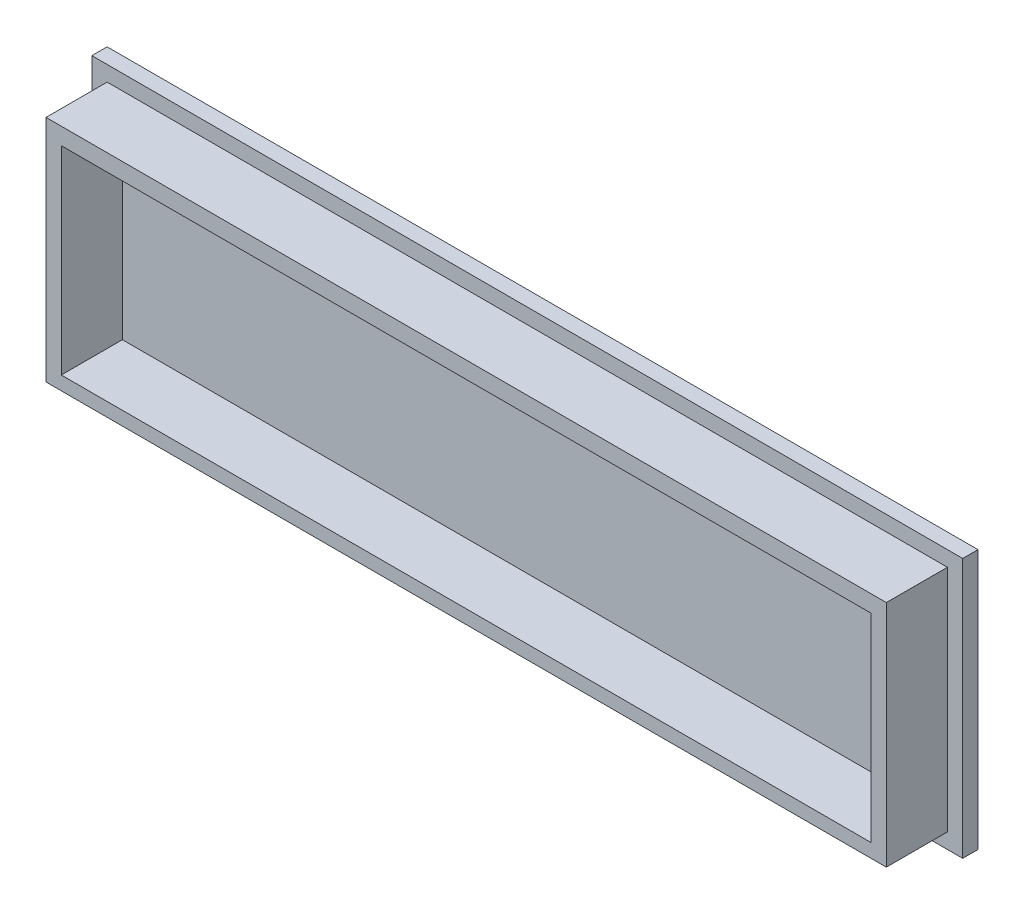
ISO-10303-21;
HEADER;
FILE_DESCRIPTION(('STEP AP214'),'2;1');
FILE_NAME('part.step','',(''),(''),'','','');
FILE_SCHEMA(('AUTOMOTIVE_DESIGN { 1 0 10303 214 1 1 1 1 }'));
ENDSEC;
DATA;
#1=APPLICATION_CONTEXT('core data for automotive mechanical design processes');
#2=APPLICATION_PROTOCOL_DEFINITION('international standard','automotive_design',2000,#1);
#3=PRODUCT_CONTEXT('',#1,'mechanical');
#4=PRODUCT('Part','Part','',(#3));
#5=PRODUCT_RELATED_PRODUCT_CATEGORY('part','',(#4));
#6=PRODUCT_DEFINITION_FORMATION('','',#4);
#7=PRODUCT_DEFINITION_CONTEXT('part definition',#1,'design');
#8=PRODUCT_DEFINITION('design','',#6,#7);
#9=PRODUCT_DEFINITION_SHAPE('','',#8);
#10=(LENGTH_UNIT() NAMED_UNIT(*) SI_UNIT(.MILLI.,.METRE.));
#11=(NAMED_UNIT(*) PLANE_ANGLE_UNIT() SI_UNIT($,.RADIAN.));
#12=(NAMED_UNIT(*) SI_UNIT($,.STERADIAN.) SOLID_ANGLE_UNIT());
#13=UNCERTAINTY_MEASURE_WITH_UNIT(LENGTH_MEASURE(1.E-05),#10,'distance_accuracy_value','');
#14=(GEOMETRIC_REPRESENTATION_CONTEXT(3) GLOBAL_UNCERTAINTY_ASSIGNED_CONTEXT((#13)) GLOBAL_UNIT_ASSIGNED_CONTEXT((#10,
#11,#12)) REPRESENTATION_CONTEXT('',''));
#15=CARTESIAN_POINT('',(0.,0.,0.));
#16=DIRECTION('',(0.,0.,1.));
#17=DIRECTION('',(1.,0.,0.));
#18=AXIS2_PLACEMENT_3D('',#15,#16,#17);
#19=CARTESIAN_POINT('',(-139.012237762238,10.5113636363637,5.));
#20=DIRECTION('',(1.,0.,0.));
#21=DIRECTION('',(0.,1.,0.));
#22=AXIS2_PLACEMENT_3D('',#19,#20,#21);
#23=PLANE('',#22);
#24=DIRECTION('',(0.,-1.,0.));
#25=VECTOR('',#24,1.);
#26=CARTESIAN_POINT('',(-139.012237762238,10.5113636363637,0.));
#27=LINE('',#26,#25);
#28=CARTESIAN_POINT('',(-139.012237762238,10.5113636363637,0.));
#29=VERTEX_POINT('',#28);
#30=CARTESIAN_POINT('',(-139.012237762238,-74.4886363636363,0.));
#31=VERTEX_POINT('',#30);
#32=EDGE_CURVE('E197',#29,#31,#27,.T.);
#33=ORIENTED_EDGE('',*,*,#32,.T.);
#34=DIRECTION('',(0.,0.,-1.));
#35=VECTOR('',#34,1.);
#36=CARTESIAN_POINT('',(-139.012237762238,-74.4886363636363,5.));
#37=LINE('',#36,#35);
#38=CARTESIAN_POINT('',(-139.012237762238,-74.4886363636363,5.));
#39=VERTEX_POINT('',#38);
#40=EDGE_CURVE('E11',#39,#31,#37,.T.);
#41=ORIENTED_EDGE('',*,*,#40,.F.);
#42=DIRECTION('',(0.,-1.,0.));
#43=VECTOR('',#42,1.);
#44=CARTESIAN_POINT('',(-139.012237762238,10.5113636363637,5.));
#45=LINE('',#44,#43);
#46=CARTESIAN_POINT('',(-139.012237762238,10.5113636363637,5.));
#47=VERTEX_POINT('',#46);
#48=EDGE_CURVE('E198',#47,#39,#45,.T.);
#49=ORIENTED_EDGE('',*,*,#48,.F.);
#50=DIRECTION('',(0.,0.,-1.));
#51=VECTOR('',#50,1.);
#52=CARTESIAN_POINT('',(-139.012237762238,10.5113636363637,5.));
#53=LINE('',#52,#51);
#54=EDGE_CURVE('E208',#47,#29,#53,.T.);
#55=ORIENTED_EDGE('',*,*,#54,.T.);
#56=EDGE_LOOP('',(#33,#41,#49,#55));
#57=FACE_BOUND('',#56,.T.);
#58=ADVANCED_FACE('F41',(#57),#23,.F.);
#59=CARTESIAN_POINT('',(-139.012237762238,-74.4886363636363,5.));
#60=DIRECTION('',(0.,1.,0.));
#61=DIRECTION('',(0.,0.,1.));
#62=AXIS2_PLACEMENT_3D('',#59,#60,#61);
#63=PLANE('',#62);
#64=DIRECTION('',(1.,0.,0.));
#65=VECTOR('',#64,1.);
#66=CARTESIAN_POINT('',(-139.012237762238,-74.4886363636363,0.));
#67=LINE('',#66,#65);
#68=CARTESIAN_POINT('',(145.987762237762,-74.4886363636363,0.));
#69=VERTEX_POINT('',#68);
#70=EDGE_CURVE('E211',#31,#69,#67,.T.);
#71=ORIENTED_EDGE('',*,*,#70,.T.);
#72=DIRECTION('',(0.,0.,-1.));
#73=VECTOR('',#72,1.);
#74=CARTESIAN_POINT('',(145.987762237762,-74.4886363636363,5.));
#75=LINE('',#74,#73);
#76=CARTESIAN_POINT('',(145.987762237762,-74.4886363636363,5.));
#77=VERTEX_POINT('',#76);
#78=EDGE_CURVE('E48',#77,#69,#75,.T.);
#79=ORIENTED_EDGE('',*,*,#78,.F.);
#80=DIRECTION('',(1.,0.,0.));
#81=VECTOR('',#80,1.);
#82=CARTESIAN_POINT('',(-139.012237762238,-74.4886363636363,5.));
#83=LINE('',#82,#81);
#84=EDGE_CURVE('E201',#39,#77,#83,.T.);
#85=ORIENTED_EDGE('',*,*,#84,.F.);
#86=ORIENTED_EDGE('',*,*,#40,.T.);
#87=EDGE_LOOP('',(#71,#79,#85,#86));
#88=FACE_BOUND('',#87,.T.);
#89=ADVANCED_FACE('F241',(#88),#63,.F.);
#90=CARTESIAN_POINT('',(145.987762237762,10.5113636363637,5.));
#91=DIRECTION('',(-1.,0.,0.));
#92=DIRECTION('',(0.,-1.,0.));
#93=AXIS2_PLACEMENT_3D('',#90,#91,#92);
#94=PLANE('',#93);
#95=DIRECTION('',(0.,1.,0.));
#96=VECTOR('',#95,1.);
#97=CARTESIAN_POINT('',(145.987762237762,10.5113636363637,0.));
#98=LINE('',#97,#96);
#99=CARTESIAN_POINT('',(145.987762237762,10.5113636363637,0.));
#100=VERTEX_POINT('',#99);
#101=EDGE_CURVE('E213',#69,#100,#98,.T.);
#102=ORIENTED_EDGE('',*,*,#101,.T.);
#103=DIRECTION('',(0.,0.,-1.));
#104=VECTOR('',#103,1.);
#105=CARTESIAN_POINT('',(145.987762237762,10.5113636363637,5.));
#106=LINE('',#105,#104);
#107=CARTESIAN_POINT('',(145.987762237762,10.5113636363637,5.));
#108=VERTEX_POINT('',#107);
#109=EDGE_CURVE('E218',#108,#100,#106,.T.);
#110=ORIENTED_EDGE('',*,*,#109,.F.);
#111=DIRECTION('',(0.,1.,0.));
#112=VECTOR('',#111,1.);
#113=CARTESIAN_POINT('',(145.987762237762,10.5113636363637,5.));
#114=LINE('',#113,#112);
#115=EDGE_CURVE('E204',#77,#108,#114,.T.);
#116=ORIENTED_EDGE('',*,*,#115,.F.);
#117=ORIENTED_EDGE('',*,*,#78,.T.);
#118=EDGE_LOOP('',(#102,#110,#116,#117));
#119=FACE_BOUND('',#118,.T.);
#120=ADVANCED_FACE('F225',(#119),#94,.F.);
#121=CARTESIAN_POINT('',(-139.012237762238,10.5113636363637,5.));
#122=DIRECTION('',(0.,-1.,0.));
#123=DIRECTION('',(0.,0.,-1.));
#124=AXIS2_PLACEMENT_3D('',#121,#122,#123);
#125=PLANE('',#124);
#126=DIRECTION('',(-1.,0.,0.));
#127=VECTOR('',#126,1.);
#128=CARTESIAN_POINT('',(-139.012237762238,10.5113636363637,0.));
#129=LINE('',#128,#127);
#130=EDGE_CURVE('E202',#100,#29,#129,.T.);
#131=ORIENTED_EDGE('',*,*,#130,.T.);
#132=ORIENTED_EDGE('',*,*,#54,.F.);
#133=DIRECTION('',(-1.,0.,0.));
#134=VECTOR('',#133,1.);
#135=CARTESIAN_POINT('',(-139.012237762238,10.5113636363637,5.));
#136=LINE('',#135,#134);
#137=EDGE_CURVE('E206',#108,#47,#136,.T.);
#138=ORIENTED_EDGE('',*,*,#137,.F.);
#139=ORIENTED_EDGE('',*,*,#109,.T.);
#140=EDGE_LOOP('',(#131,#132,#138,#139));
#141=FACE_BOUND('',#140,.T.);
#142=ADVANCED_FACE('F234',(#141),#125,.F.);
#143=CARTESIAN_POINT('',(0.,0.,5.));
#144=DIRECTION('',(0.,0.,1.));
#145=DIRECTION('',(1.,0.,0.));
#146=AXIS2_PLACEMENT_3D('',#143,#144,#145);
#147=PLANE('',#146);
#148=DIRECTION('',(0.,-1.,0.));
#149=VECTOR('',#148,1.);
#150=CARTESIAN_POINT('',(-134.012237762238,5.51136363636367,5.));
#151=LINE('',#150,#149);
#152=CARTESIAN_POINT('',(-134.012237762238,5.51136363636367,5.));
#153=VERTEX_POINT('',#152);
#154=CARTESIAN_POINT('',(-134.012237762238,-69.4886363636363,5.));
#155=VERTEX_POINT('',#154);
#156=EDGE_CURVE('E63',#153,#155,#151,.T.);
#157=ORIENTED_EDGE('',*,*,#156,.F.);
#158=DIRECTION('',(-1.,0.,0.));
#159=VECTOR('',#158,1.);
#160=CARTESIAN_POINT('',(-134.012237762238,5.51136363636367,5.));
#161=LINE('',#160,#159);
#162=CARTESIAN_POINT('',(140.987762237762,5.51136363636367,5.));
#163=VERTEX_POINT('',#162);
#164=EDGE_CURVE('E171',#163,#153,#161,.T.);
#165=ORIENTED_EDGE('',*,*,#164,.F.);
#166=DIRECTION('',(0.,1.,0.));
#167=VECTOR('',#166,1.);
#168=CARTESIAN_POINT('',(140.987762237762,5.51136363636367,5.));
#169=LINE('',#168,#167);
#170=CARTESIAN_POINT('',(140.987762237762,-69.4886363636363,5.));
#171=VERTEX_POINT('',#170);
#172=EDGE_CURVE('E182',#171,#163,#169,.T.);
#173=ORIENTED_EDGE('',*,*,#172,.F.);
#174=DIRECTION('',(1.,0.,0.));
#175=VECTOR('',#174,1.);
#176=CARTESIAN_POINT('',(-134.012237762238,-69.4886363636363,5.));
#177=LINE('',#176,#175);
#178=EDGE_CURVE('E179',#155,#171,#177,.T.);
#179=ORIENTED_EDGE('',*,*,#178,.F.);
#180=EDGE_LOOP('',(#157,#165,#173,#179));
#181=FACE_BOUND('',#180,.T.);
#182=ORIENTED_EDGE('',*,*,#48,.T.);
#183=ORIENTED_EDGE('',*,*,#84,.T.);
#184=ORIENTED_EDGE('',*,*,#115,.T.);
#185=ORIENTED_EDGE('',*,*,#137,.T.);
#186=EDGE_LOOP('',(#182,#183,#184,#185));
#187=FACE_BOUND('',#186,.T.);
#188=ADVANCED_FACE('F240',(#181,#187),#147,.T.);
#189=CARTESIAN_POINT('',(0.,0.,0.));
#190=DIRECTION('',(0.,0.,1.));
#191=DIRECTION('',(1.,0.,0.));
#192=AXIS2_PLACEMENT_3D('',#189,#190,#191);
#193=PLANE('',#192);
#194=ORIENTED_EDGE('',*,*,#32,.F.);
#195=ORIENTED_EDGE('',*,*,#130,.F.);
#196=ORIENTED_EDGE('',*,*,#101,.F.);
#197=ORIENTED_EDGE('',*,*,#70,.F.);
#198=EDGE_LOOP('',(#194,#195,#196,#197));
#199=FACE_BOUND('',#198,.T.);
#200=ADVANCED_FACE('F231',(#199),#193,.F.);
#201=CARTESIAN_POINT('',(-134.012237762238,5.51136363636367,25.));
#202=DIRECTION('',(1.,0.,0.));
#203=DIRECTION('',(0.,0.,-1.));
#204=AXIS2_PLACEMENT_3D('',#201,#202,#203);
#205=PLANE('',#204);
#206=ORIENTED_EDGE('',*,*,#156,.T.);
#207=DIRECTION('',(0.,0.,-1.));
#208=VECTOR('',#207,1.);
#209=CARTESIAN_POINT('',(-134.012237762238,-69.4886363636363,25.));
#210=LINE('',#209,#208);
#211=CARTESIAN_POINT('',(-134.012237762238,-69.4886363636363,25.));
#212=VERTEX_POINT('',#211);
#213=EDGE_CURVE('E194',#212,#155,#210,.T.);
#214=ORIENTED_EDGE('',*,*,#213,.F.);
#215=DIRECTION('',(0.,-1.,0.));
#216=VECTOR('',#215,1.);
#217=CARTESIAN_POINT('',(-134.012237762238,5.51136363636367,25.));
#218=LINE('',#217,#216);
#219=CARTESIAN_POINT('',(-134.012237762238,5.51136363636367,25.));
#220=VERTEX_POINT('',#219);
#221=EDGE_CURVE('E167',#220,#212,#218,.T.);
#222=ORIENTED_EDGE('',*,*,#221,.F.);
#223=DIRECTION('',(0.,0.,-1.));
#224=VECTOR('',#223,1.);
#225=CARTESIAN_POINT('',(-134.012237762238,5.51136363636367,25.));
#226=LINE('',#225,#224);
#227=EDGE_CURVE('E177',#220,#153,#226,.T.);
#228=ORIENTED_EDGE('',*,*,#227,.T.);
#229=EDGE_LOOP('',(#206,#214,#222,#228));
#230=FACE_BOUND('',#229,.T.);
#231=ADVANCED_FACE('F253',(#230),#205,.F.);
#232=CARTESIAN_POINT('',(-134.012237762238,-69.4886363636363,25.));
#233=DIRECTION('',(0.,1.,0.));
#234=DIRECTION('',(0.,0.,1.));
#235=AXIS2_PLACEMENT_3D('',#232,#233,#234);
#236=PLANE('',#235);
#237=ORIENTED_EDGE('',*,*,#178,.T.);
#238=DIRECTION('',(0.,0.,-1.));
#239=VECTOR('',#238,1.);
#240=CARTESIAN_POINT('',(140.987762237762,-69.4886363636363,25.));
#241=LINE('',#240,#239);
#242=CARTESIAN_POINT('',(140.987762237762,-69.4886363636363,25.));
#243=VERTEX_POINT('',#242);
#244=EDGE_CURVE('E191',#243,#171,#241,.T.);
#245=ORIENTED_EDGE('',*,*,#244,.F.);
#246=DIRECTION('',(1.,0.,0.));
#247=VECTOR('',#246,1.);
#248=CARTESIAN_POINT('',(-134.012237762238,-69.4886363636363,25.));
#249=LINE('',#248,#247);
#250=EDGE_CURVE('E170',#212,#243,#249,.T.);
#251=ORIENTED_EDGE('',*,*,#250,.F.);
#252=ORIENTED_EDGE('',*,*,#213,.T.);
#253=EDGE_LOOP('',(#237,#245,#251,#252));
#254=FACE_BOUND('',#253,.T.);
#255=ADVANCED_FACE('F258',(#254),#236,.F.);
#256=CARTESIAN_POINT('',(140.987762237762,5.51136363636367,25.));
#257=DIRECTION('',(-1.,0.,0.));
#258=DIRECTION('',(0.,0.,1.));
#259=AXIS2_PLACEMENT_3D('',#256,#257,#258);
#260=PLANE('',#259);
#261=ORIENTED_EDGE('',*,*,#172,.T.);
#262=DIRECTION('',(0.,0.,-1.));
#263=VECTOR('',#262,1.);
#264=CARTESIAN_POINT('',(140.987762237762,5.51136363636367,25.));
#265=LINE('',#264,#263);
#266=CARTESIAN_POINT('',(140.987762237762,5.51136363636367,25.));
#267=VERTEX_POINT('',#266);
#268=EDGE_CURVE('E188',#267,#163,#265,.T.);
#269=ORIENTED_EDGE('',*,*,#268,.F.);
#270=DIRECTION('',(0.,1.,0.));
#271=VECTOR('',#270,1.);
#272=CARTESIAN_POINT('',(140.987762237762,5.51136363636367,25.));
#273=LINE('',#272,#271);
#274=EDGE_CURVE('E173',#243,#267,#273,.T.);
#275=ORIENTED_EDGE('',*,*,#274,.F.);
#276=ORIENTED_EDGE('',*,*,#244,.T.);
#277=EDGE_LOOP('',(#261,#269,#275,#276));
#278=FACE_BOUND('',#277,.T.);
#279=ADVANCED_FACE('F262',(#278),#260,.F.);
#280=CARTESIAN_POINT('',(-134.012237762238,5.51136363636367,25.));
#281=DIRECTION('',(0.,-1.,0.));
#282=DIRECTION('',(0.,0.,-1.));
#283=AXIS2_PLACEMENT_3D('',#280,#281,#282);
#284=PLANE('',#283);
#285=ORIENTED_EDGE('',*,*,#164,.T.);
#286=ORIENTED_EDGE('',*,*,#227,.F.);
#287=DIRECTION('',(-1.,0.,0.));
#288=VECTOR('',#287,1.);
#289=CARTESIAN_POINT('',(-134.012237762238,5.51136363636367,25.));
#290=LINE('',#289,#288);
#291=EDGE_CURVE('E175',#267,#220,#290,.T.);
#292=ORIENTED_EDGE('',*,*,#291,.F.);
#293=ORIENTED_EDGE('',*,*,#268,.T.);
#294=EDGE_LOOP('',(#285,#286,#292,#293));
#295=FACE_BOUND('',#294,.T.);
#296=ADVANCED_FACE('F266',(#295),#284,.F.);
#297=CARTESIAN_POINT('',(0.,0.,25.));
#298=DIRECTION('',(0.,0.,1.));
#299=DIRECTION('',(1.,0.,0.));
#300=AXIS2_PLACEMENT_3D('',#297,#298,#299);
#301=PLANE('',#300);
#302=DIRECTION('',(0.,-1.,0.));
#303=VECTOR('',#302,1.);
#304=CARTESIAN_POINT('',(-129.012237762238,0.,25.));
#305=LINE('',#304,#303);
#306=CARTESIAN_POINT('',(-129.012237762238,0.,25.));
#307=VERTEX_POINT('',#306);
#308=CARTESIAN_POINT('',(-129.012237762238,-65.,25.));
#309=VERTEX_POINT('',#308);
#310=EDGE_CURVE('E55',#307,#309,#305,.T.);
#311=ORIENTED_EDGE('',*,*,#310,.F.);
#312=DIRECTION('',(-1.,0.,0.));
#313=VECTOR('',#312,1.);
#314=CARTESIAN_POINT('',(-129.012237762238,0.,25.));
#315=LINE('',#314,#313);
#316=CARTESIAN_POINT('',(135.987762237762,0.,25.));
#317=VERTEX_POINT('',#316);
#318=EDGE_CURVE('E149',#317,#307,#315,.T.);
#319=ORIENTED_EDGE('',*,*,#318,.F.);
#320=DIRECTION('',(0.,1.,0.));
#321=VECTOR('',#320,1.);
#322=CARTESIAN_POINT('',(135.987762237762,0.,25.));
#323=LINE('',#322,#321);
#324=CARTESIAN_POINT('',(135.987762237762,-65.,25.));
#325=VERTEX_POINT('',#324);
#326=EDGE_CURVE('E152',#325,#317,#323,.T.);
#327=ORIENTED_EDGE('',*,*,#326,.F.);
#328=DIRECTION('',(1.,0.,0.));
#329=VECTOR('',#328,1.);
#330=CARTESIAN_POINT('',(-129.012237762238,-65.,25.));
#331=LINE('',#330,#329);
#332=EDGE_CURVE('E158',#309,#325,#331,.T.);
#333=ORIENTED_EDGE('',*,*,#332,.F.);
#334=EDGE_LOOP('',(#311,#319,#327,#333));
#335=FACE_BOUND('',#334,.T.);
#336=ORIENTED_EDGE('',*,*,#221,.T.);
#337=ORIENTED_EDGE('',*,*,#250,.T.);
#338=ORIENTED_EDGE('',*,*,#274,.T.);
#339=ORIENTED_EDGE('',*,*,#291,.T.);
#340=EDGE_LOOP('',(#336,#337,#338,#339));
#341=FACE_BOUND('',#340,.T.);
#342=ADVANCED_FACE('F270',(#335,#341),#301,.T.);
#343=CARTESIAN_POINT('',(-129.012237762238,0.,5.));
#344=DIRECTION('',(-1.,0.,0.));
#345=DIRECTION('',(0.,0.,1.));
#346=AXIS2_PLACEMENT_3D('',#343,#344,#345);
#347=PLANE('',#346);
#348=ORIENTED_EDGE('',*,*,#310,.T.);
#349=DIRECTION('',(0.,0.,1.));
#350=VECTOR('',#349,1.);
#351=CARTESIAN_POINT('',(-129.012237762238,-65.,5.));
#352=LINE('',#351,#350);
#353=CARTESIAN_POINT('',(-129.012237762238,-65.,5.));
#354=VERTEX_POINT('',#353);
#355=EDGE_CURVE('E127',#354,#309,#352,.T.);
#356=ORIENTED_EDGE('',*,*,#355,.F.);
#357=DIRECTION('',(0.,-1.,0.));
#358=VECTOR('',#357,1.);
#359=CARTESIAN_POINT('',(-129.012237762238,0.,5.));
#360=LINE('',#359,#358);
#361=CARTESIAN_POINT('',(-129.012237762238,0.,5.));
#362=VERTEX_POINT('',#361);
#363=EDGE_CURVE('E131',#362,#354,#360,.T.);
#364=ORIENTED_EDGE('',*,*,#363,.F.);
#365=DIRECTION('',(0.,0.,1.));
#366=VECTOR('',#365,1.);
#367=CARTESIAN_POINT('',(-129.012237762238,0.,5.));
#368=LINE('',#367,#366);
#369=EDGE_CURVE('E162',#362,#307,#368,.T.);
#370=ORIENTED_EDGE('',*,*,#369,.T.);
#371=EDGE_LOOP('',(#348,#356,#364,#370));
#372=FACE_BOUND('',#371,.T.);
#373=ADVANCED_FACE('F129',(#372),#347,.F.);
#374=CARTESIAN_POINT('',(-129.012237762238,0.,5.));
#375=DIRECTION('',(0.,1.,0.));
#376=DIRECTION('',(-1.,0.,0.));
#377=AXIS2_PLACEMENT_3D('',#374,#375,#376);
#378=PLANE('',#377);
#379=ORIENTED_EDGE('',*,*,#318,.T.);
#380=ORIENTED_EDGE('',*,*,#369,.F.);
#381=DIRECTION('',(-1.,0.,0.));
#382=VECTOR('',#381,1.);
#383=CARTESIAN_POINT('',(-129.012237762238,0.,5.));
#384=LINE('',#383,#382);
#385=CARTESIAN_POINT('',(135.987762237762,0.,5.));
#386=VERTEX_POINT('',#385);
#387=EDGE_CURVE('E137',#386,#362,#384,.T.);
#388=ORIENTED_EDGE('',*,*,#387,.F.);
#389=DIRECTION('',(0.,0.,1.));
#390=VECTOR('',#389,1.);
#391=CARTESIAN_POINT('',(135.987762237762,0.,5.));
#392=LINE('',#391,#390);
#393=EDGE_CURVE('E164',#386,#317,#392,.T.);
#394=ORIENTED_EDGE('',*,*,#393,.T.);
#395=EDGE_LOOP('',(#379,#380,#388,#394));
#396=FACE_BOUND('',#395,.T.);
#397=ADVANCED_FACE('F277',(#396),#378,.F.);
#398=CARTESIAN_POINT('',(135.987762237762,0.,5.));
#399=DIRECTION('',(1.,0.,0.));
#400=DIRECTION('',(0.,0.,-1.));
#401=AXIS2_PLACEMENT_3D('',#398,#399,#400);
#402=PLANE('',#401);
#403=ORIENTED_EDGE('',*,*,#326,.T.);
#404=ORIENTED_EDGE('',*,*,#393,.F.);
#405=DIRECTION('',(0.,1.,0.));
#406=VECTOR('',#405,1.);
#407=CARTESIAN_POINT('',(135.987762237762,0.,5.));
#408=LINE('',#407,#406);
#409=CARTESIAN_POINT('',(135.987762237762,-65.,5.));
#410=VERTEX_POINT('',#409);
#411=EDGE_CURVE('E145',#410,#386,#408,.T.);
#412=ORIENTED_EDGE('',*,*,#411,.F.);
#413=DIRECTION('',(0.,0.,1.));
#414=VECTOR('',#413,1.);
#415=CARTESIAN_POINT('',(135.987762237762,-65.,5.));
#416=LINE('',#415,#414);
#417=EDGE_CURVE('E136',#410,#325,#416,.T.);
#418=ORIENTED_EDGE('',*,*,#417,.T.);
#419=EDGE_LOOP('',(#403,#404,#412,#418));
#420=FACE_BOUND('',#419,.T.);
#421=ADVANCED_FACE('F280',(#420),#402,.F.);
#422=CARTESIAN_POINT('',(-129.012237762238,-65.,5.));
#423=DIRECTION('',(0.,-1.,0.));
#424=DIRECTION('',(0.,0.,-1.));
#425=AXIS2_PLACEMENT_3D('',#422,#423,#424);
#426=PLANE('',#425);
#427=ORIENTED_EDGE('',*,*,#332,.T.);
#428=ORIENTED_EDGE('',*,*,#417,.F.);
#429=DIRECTION('',(1.,0.,0.));
#430=VECTOR('',#429,1.);
#431=CARTESIAN_POINT('',(-129.012237762238,-65.,5.));
#432=LINE('',#431,#430);
#433=EDGE_CURVE('E140',#354,#410,#432,.T.);
#434=ORIENTED_EDGE('',*,*,#433,.F.);
#435=ORIENTED_EDGE('',*,*,#355,.T.);
#436=EDGE_LOOP('',(#427,#428,#434,#435));
#437=FACE_BOUND('',#436,.T.);
#438=ADVANCED_FACE('F141',(#437),#426,.F.);
#439=CARTESIAN_POINT('',(0.,0.,5.));
#440=DIRECTION('',(0.,0.,1.));
#441=DIRECTION('',(1.,0.,0.));
#442=AXIS2_PLACEMENT_3D('',#439,#440,#441);
#443=PLANE('',#442);
#444=ORIENTED_EDGE('',*,*,#363,.T.);
#445=ORIENTED_EDGE('',*,*,#433,.T.);
#446=ORIENTED_EDGE('',*,*,#411,.T.);
#447=ORIENTED_EDGE('',*,*,#387,.T.);
#448=EDGE_LOOP('',(#444,#445,#446,#447));
#449=FACE_BOUND('',#448,.T.);
#450=ADVANCED_FACE('F147',(#449),#443,.T.);
#451=CLOSED_SHELL('',(#58,#89,#120,#142,#188,#200,#231,#255,#279,#296,#342,#373,#397,#421,#438,#450));
#452=MANIFOLD_SOLID_BREP('B2',#451);
#453=ADVANCED_BREP_SHAPE_REPRESENTATION('',(#18,#452),#14);
#454=SHAPE_DEFINITION_REPRESENTATION(#9,#453);
ENDSEC;
END-ISO-10303-21;
